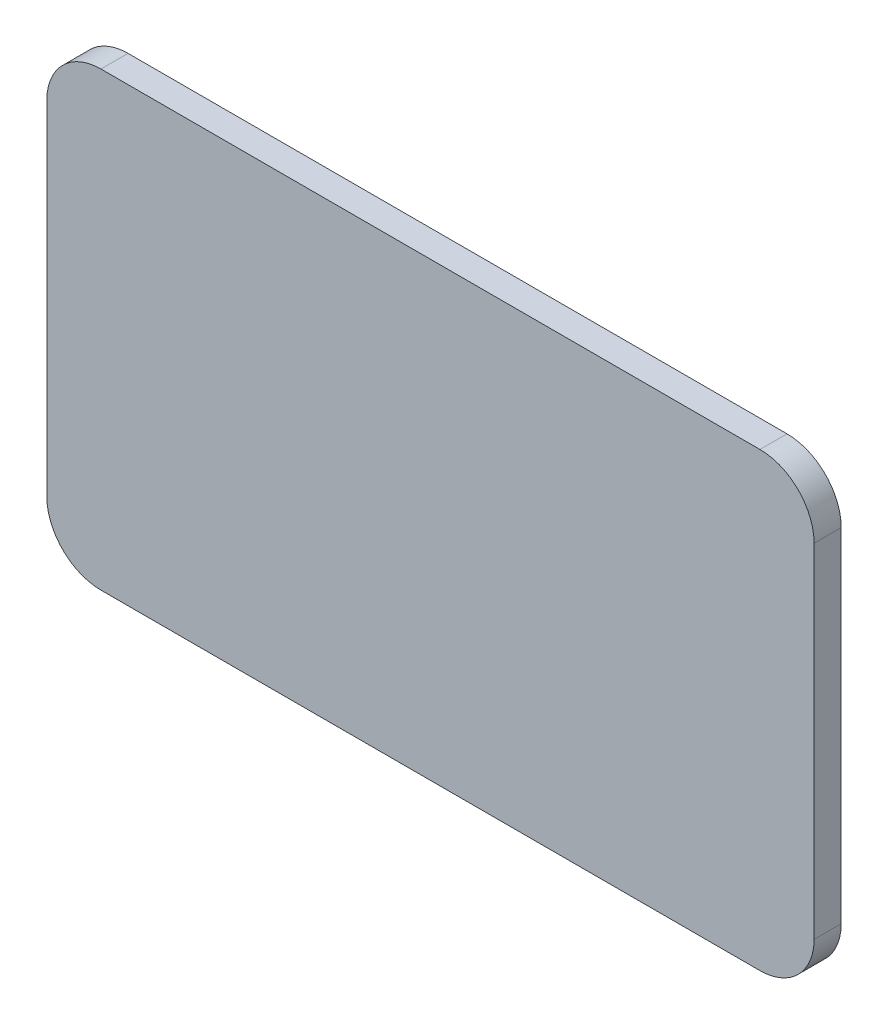
ISO-10303-21;
HEADER;
FILE_DESCRIPTION(('STEP AP214'),'2;1');
FILE_NAME('part.step','',(''),(''),'','','');
FILE_SCHEMA(('AUTOMOTIVE_DESIGN { 1 0 10303 214 1 1 1 1 }'));
ENDSEC;
DATA;
#1=APPLICATION_CONTEXT('core data for automotive mechanical design processes');
#2=APPLICATION_PROTOCOL_DEFINITION('international standard','automotive_design',2000,#1);
#3=PRODUCT_CONTEXT('',#1,'mechanical');
#4=PRODUCT('Part','Part','',(#3));
#5=PRODUCT_RELATED_PRODUCT_CATEGORY('part','',(#4));
#6=PRODUCT_DEFINITION_FORMATION('','',#4);
#7=PRODUCT_DEFINITION_CONTEXT('part definition',#1,'design');
#8=PRODUCT_DEFINITION('design','',#6,#7);
#9=PRODUCT_DEFINITION_SHAPE('','',#8);
#10=(LENGTH_UNIT() NAMED_UNIT(*) SI_UNIT(.MILLI.,.METRE.));
#11=(NAMED_UNIT(*) PLANE_ANGLE_UNIT() SI_UNIT($,.RADIAN.));
#12=(NAMED_UNIT(*) SI_UNIT($,.STERADIAN.) SOLID_ANGLE_UNIT());
#13=UNCERTAINTY_MEASURE_WITH_UNIT(LENGTH_MEASURE(1.E-05),#10,'distance_accuracy_value','');
#14=(GEOMETRIC_REPRESENTATION_CONTEXT(3) GLOBAL_UNCERTAINTY_ASSIGNED_CONTEXT((#13)) GLOBAL_UNIT_ASSIGNED_CONTEXT((#10,
#11,#12)) REPRESENTATION_CONTEXT('',''));
#15=CARTESIAN_POINT('',(0.,0.,0.));
#16=DIRECTION('',(0.,0.,1.));
#17=DIRECTION('',(1.,0.,0.));
#18=AXIS2_PLACEMENT_3D('',#15,#16,#17);
#19=CARTESIAN_POINT('',(0.,-25.,3.));
#20=DIRECTION('',(0.,1.,0.));
#21=DIRECTION('',(0.,0.,1.));
#22=AXIS2_PLACEMENT_3D('',#19,#20,#21);
#23=PLANE('',#22);
#24=DIRECTION('',(1.,0.,0.));
#25=VECTOR('',#24,1.);
#26=CARTESIAN_POINT('',(0.,-25.,0.));
#27=LINE('',#26,#25);
#28=CARTESIAN_POINT('',(-36.5,-25.,0.));
#29=VERTEX_POINT('',#28);
#30=CARTESIAN_POINT('',(36.5,-25.,0.));
#31=VERTEX_POINT('',#30);
#32=EDGE_CURVE('E132',#29,#31,#27,.T.);
#33=ORIENTED_EDGE('',*,*,#32,.T.);
#34=DIRECTION('',(0.,0.,-1.));
#35=VECTOR('',#34,1.);
#36=CARTESIAN_POINT('',(36.5,-25.,3.));
#37=LINE('',#36,#35);
#38=CARTESIAN_POINT('',(36.5,-25.,3.));
#39=VERTEX_POINT('',#38);
#40=EDGE_CURVE('E11',#39,#31,#37,.T.);
#41=ORIENTED_EDGE('',*,*,#40,.F.);
#42=DIRECTION('',(1.,0.,0.));
#43=VECTOR('',#42,1.);
#44=CARTESIAN_POINT('',(0.,-25.,3.));
#45=LINE('',#44,#43);
#46=CARTESIAN_POINT('',(-36.5,-25.,3.));
#47=VERTEX_POINT('',#46);
#48=EDGE_CURVE('E151',#47,#39,#45,.T.);
#49=ORIENTED_EDGE('',*,*,#48,.F.);
#50=DIRECTION('',(0.,0.,-1.));
#51=VECTOR('',#50,1.);
#52=CARTESIAN_POINT('',(-36.5,-25.,3.));
#53=LINE('',#52,#51);
#54=EDGE_CURVE('E51',#47,#29,#53,.T.);
#55=ORIENTED_EDGE('',*,*,#54,.T.);
#56=EDGE_LOOP('',(#33,#41,#49,#55));
#57=FACE_BOUND('',#56,.T.);
#58=ADVANCED_FACE('F35',(#57),#23,.F.);
#59=CARTESIAN_POINT('',(36.5,-19.,3.));
#60=DIRECTION('',(0.,0.,-1.));
#61=DIRECTION('',(-1.,0.,0.));
#62=AXIS2_PLACEMENT_3D('',#59,#60,#61);
#63=CYLINDRICAL_SURFACE('',#62,6.);
#64=CARTESIAN_POINT('',(36.5,-19.,0.));
#65=DIRECTION('',(0.,0.,1.));
#66=DIRECTION('',(1.,0.,0.));
#67=AXIS2_PLACEMENT_3D('',#64,#65,#66);
#68=CIRCLE('',#67,6.);
#69=CARTESIAN_POINT('',(42.5,-19.,0.));
#70=VERTEX_POINT('',#69);
#71=EDGE_CURVE('E134',#31,#70,#68,.T.);
#72=ORIENTED_EDGE('',*,*,#71,.T.);
#73=DIRECTION('',(0.,0.,-1.));
#74=VECTOR('',#73,1.);
#75=CARTESIAN_POINT('',(42.5,-19.,3.));
#76=LINE('',#75,#74);
#77=CARTESIAN_POINT('',(42.5,-19.,3.));
#78=VERTEX_POINT('',#77);
#79=EDGE_CURVE('E43',#78,#70,#76,.T.);
#80=ORIENTED_EDGE('',*,*,#79,.F.);
#81=CARTESIAN_POINT('',(36.5,-19.,3.));
#82=DIRECTION('',(0.,0.,1.));
#83=DIRECTION('',(1.,0.,0.));
#84=AXIS2_PLACEMENT_3D('',#81,#82,#83);
#85=CIRCLE('',#84,6.);
#86=EDGE_CURVE('E89',#39,#78,#85,.T.);
#87=ORIENTED_EDGE('',*,*,#86,.F.);
#88=ORIENTED_EDGE('',*,*,#40,.T.);
#89=EDGE_LOOP('',(#72,#80,#87,#88));
#90=FACE_BOUND('',#89,.T.);
#91=ADVANCED_FACE('F178',(#90),#63,.T.);
#92=CARTESIAN_POINT('',(42.5,0.,3.));
#93=DIRECTION('',(-1.,0.,0.));
#94=DIRECTION('',(0.,0.,1.));
#95=AXIS2_PLACEMENT_3D('',#92,#93,#94);
#96=PLANE('',#95);
#97=DIRECTION('',(0.,1.,0.));
#98=VECTOR('',#97,1.);
#99=CARTESIAN_POINT('',(42.5,0.,0.));
#100=LINE('',#99,#98);
#101=CARTESIAN_POINT('',(42.5,19.,0.));
#102=VERTEX_POINT('',#101);
#103=EDGE_CURVE('E136',#70,#102,#100,.T.);
#104=ORIENTED_EDGE('',*,*,#103,.T.);
#105=DIRECTION('',(0.,0.,-1.));
#106=VECTOR('',#105,1.);
#107=CARTESIAN_POINT('',(42.5,19.,3.));
#108=LINE('',#107,#106);
#109=CARTESIAN_POINT('',(42.5,19.,3.));
#110=VERTEX_POINT('',#109);
#111=EDGE_CURVE('E157',#110,#102,#108,.T.);
#112=ORIENTED_EDGE('',*,*,#111,.F.);
#113=DIRECTION('',(0.,1.,0.));
#114=VECTOR('',#113,1.);
#115=CARTESIAN_POINT('',(42.5,0.,3.));
#116=LINE('',#115,#114);
#117=EDGE_CURVE('E164',#78,#110,#116,.T.);
#118=ORIENTED_EDGE('',*,*,#117,.F.);
#119=ORIENTED_EDGE('',*,*,#79,.T.);
#120=EDGE_LOOP('',(#104,#112,#118,#119));
#121=FACE_BOUND('',#120,.T.);
#122=ADVANCED_FACE('F162',(#121),#96,.F.);
#123=CARTESIAN_POINT('',(36.5,19.,3.));
#124=DIRECTION('',(0.,0.,-1.));
#125=DIRECTION('',(-1.,0.,0.));
#126=AXIS2_PLACEMENT_3D('',#123,#124,#125);
#127=CYLINDRICAL_SURFACE('',#126,6.);
#128=CARTESIAN_POINT('',(36.5,19.,0.));
#129=DIRECTION('',(0.,0.,1.));
#130=DIRECTION('',(1.,0.,0.));
#131=AXIS2_PLACEMENT_3D('',#128,#129,#130);
#132=CIRCLE('',#131,6.);
#133=CARTESIAN_POINT('',(36.5,25.,0.));
#134=VERTEX_POINT('',#133);
#135=EDGE_CURVE('E139',#134,#102,#132,.F.);
#136=ORIENTED_EDGE('',*,*,#135,.F.);
#137=DIRECTION('',(0.,0.,-1.));
#138=VECTOR('',#137,1.);
#139=CARTESIAN_POINT('',(36.5,25.,3.));
#140=LINE('',#139,#138);
#141=CARTESIAN_POINT('',(36.5,25.,3.));
#142=VERTEX_POINT('',#141);
#143=EDGE_CURVE('E155',#142,#134,#140,.T.);
#144=ORIENTED_EDGE('',*,*,#143,.F.);
#145=CARTESIAN_POINT('',(36.5,19.,3.));
#146=DIRECTION('',(0.,0.,1.));
#147=DIRECTION('',(1.,0.,0.));
#148=AXIS2_PLACEMENT_3D('',#145,#146,#147);
#149=CIRCLE('',#148,6.);
#150=EDGE_CURVE('E172',#142,#110,#149,.F.);
#151=ORIENTED_EDGE('',*,*,#150,.T.);
#152=ORIENTED_EDGE('',*,*,#111,.T.);
#153=EDGE_LOOP('',(#136,#144,#151,#152));
#154=FACE_BOUND('',#153,.T.);
#155=ADVANCED_FACE('F170',(#154),#127,.T.);
#156=CARTESIAN_POINT('',(0.,25.,3.));
#157=DIRECTION('',(0.,1.,0.));
#158=DIRECTION('',(0.,0.,1.));
#159=AXIS2_PLACEMENT_3D('',#156,#157,#158);
#160=PLANE('',#159);
#161=DIRECTION('',(1.,0.,0.));
#162=VECTOR('',#161,1.);
#163=CARTESIAN_POINT('',(0.,25.,0.));
#164=LINE('',#163,#162);
#165=CARTESIAN_POINT('',(-36.5,25.,0.));
#166=VERTEX_POINT('',#165);
#167=EDGE_CURVE('E142',#166,#134,#164,.T.);
#168=ORIENTED_EDGE('',*,*,#167,.F.);
#169=DIRECTION('',(0.,0.,-1.));
#170=VECTOR('',#169,1.);
#171=CARTESIAN_POINT('',(-36.5,25.,3.));
#172=LINE('',#171,#170);
#173=CARTESIAN_POINT('',(-36.5,25.,3.));
#174=VERTEX_POINT('',#173);
#175=EDGE_CURVE('E114',#174,#166,#172,.T.);
#176=ORIENTED_EDGE('',*,*,#175,.F.);
#177=DIRECTION('',(1.,0.,0.));
#178=VECTOR('',#177,1.);
#179=CARTESIAN_POINT('',(0.,25.,3.));
#180=LINE('',#179,#178);
#181=EDGE_CURVE('E124',#174,#142,#180,.T.);
#182=ORIENTED_EDGE('',*,*,#181,.T.);
#183=ORIENTED_EDGE('',*,*,#143,.T.);
#184=EDGE_LOOP('',(#168,#176,#182,#183));
#185=FACE_BOUND('',#184,.T.);
#186=ADVANCED_FACE('F188',(#185),#160,.T.);
#187=CARTESIAN_POINT('',(-36.5,19.,3.));
#188=DIRECTION('',(0.,0.,-1.));
#189=DIRECTION('',(-1.,0.,0.));
#190=AXIS2_PLACEMENT_3D('',#187,#188,#189);
#191=CYLINDRICAL_SURFACE('',#190,6.);
#192=CARTESIAN_POINT('',(-36.5,19.,0.));
#193=DIRECTION('',(0.,0.,1.));
#194=DIRECTION('',(1.,0.,0.));
#195=AXIS2_PLACEMENT_3D('',#192,#193,#194);
#196=CIRCLE('',#195,6.);
#197=CARTESIAN_POINT('',(-42.5,19.,0.));
#198=VERTEX_POINT('',#197);
#199=EDGE_CURVE('E110',#198,#166,#196,.F.);
#200=ORIENTED_EDGE('',*,*,#199,.F.);
#201=DIRECTION('',(0.,0.,-1.));
#202=VECTOR('',#201,1.);
#203=CARTESIAN_POINT('',(-42.5,19.,3.));
#204=LINE('',#203,#202);
#205=CARTESIAN_POINT('',(-42.5,19.,3.));
#206=VERTEX_POINT('',#205);
#207=EDGE_CURVE('E105',#206,#198,#204,.T.);
#208=ORIENTED_EDGE('',*,*,#207,.F.);
#209=CARTESIAN_POINT('',(-36.5,19.,3.));
#210=DIRECTION('',(0.,0.,1.));
#211=DIRECTION('',(1.,0.,0.));
#212=AXIS2_PLACEMENT_3D('',#209,#210,#211);
#213=CIRCLE('',#212,6.);
#214=EDGE_CURVE('E108',#206,#174,#213,.F.);
#215=ORIENTED_EDGE('',*,*,#214,.T.);
#216=ORIENTED_EDGE('',*,*,#175,.T.);
#217=EDGE_LOOP('',(#200,#208,#215,#216));
#218=FACE_BOUND('',#217,.T.);
#219=ADVANCED_FACE('F107',(#218),#191,.T.);
#220=CARTESIAN_POINT('',(-42.5,0.,3.));
#221=DIRECTION('',(-1.,0.,0.));
#222=DIRECTION('',(0.,0.,1.));
#223=AXIS2_PLACEMENT_3D('',#220,#221,#222);
#224=PLANE('',#223);
#225=DIRECTION('',(0.,1.,0.));
#226=VECTOR('',#225,1.);
#227=CARTESIAN_POINT('',(-42.5,0.,0.));
#228=LINE('',#227,#226);
#229=CARTESIAN_POINT('',(-42.5,-19.,0.));
#230=VERTEX_POINT('',#229);
#231=EDGE_CURVE('E146',#230,#198,#228,.T.);
#232=ORIENTED_EDGE('',*,*,#231,.F.);
#233=DIRECTION('',(0.,0.,-1.));
#234=VECTOR('',#233,1.);
#235=CARTESIAN_POINT('',(-42.5,-19.,3.));
#236=LINE('',#235,#234);
#237=CARTESIAN_POINT('',(-42.5,-19.,3.));
#238=VERTEX_POINT('',#237);
#239=EDGE_CURVE('E77',#238,#230,#236,.T.);
#240=ORIENTED_EDGE('',*,*,#239,.F.);
#241=DIRECTION('',(0.,1.,0.));
#242=VECTOR('',#241,1.);
#243=CARTESIAN_POINT('',(-42.5,0.,3.));
#244=LINE('',#243,#242);
#245=EDGE_CURVE('E121',#238,#206,#244,.T.);
#246=ORIENTED_EDGE('',*,*,#245,.T.);
#247=ORIENTED_EDGE('',*,*,#207,.T.);
#248=EDGE_LOOP('',(#232,#240,#246,#247));
#249=FACE_BOUND('',#248,.T.);
#250=ADVANCED_FACE('F126',(#249),#224,.T.);
#251=CARTESIAN_POINT('',(-36.5,-19.,3.));
#252=DIRECTION('',(0.,0.,-1.));
#253=DIRECTION('',(-1.,0.,0.));
#254=AXIS2_PLACEMENT_3D('',#251,#252,#253);
#255=CYLINDRICAL_SURFACE('',#254,6.);
#256=CARTESIAN_POINT('',(-36.5,-19.,0.));
#257=DIRECTION('',(0.,0.,1.));
#258=DIRECTION('',(1.,0.,0.));
#259=AXIS2_PLACEMENT_3D('',#256,#257,#258);
#260=CIRCLE('',#259,6.);
#261=EDGE_CURVE('E148',#29,#230,#260,.F.);
#262=ORIENTED_EDGE('',*,*,#261,.F.);
#263=ORIENTED_EDGE('',*,*,#54,.F.);
#264=CARTESIAN_POINT('',(-36.5,-19.,3.));
#265=DIRECTION('',(0.,0.,1.));
#266=DIRECTION('',(1.,0.,0.));
#267=AXIS2_PLACEMENT_3D('',#264,#265,#266);
#268=CIRCLE('',#267,6.);
#269=EDGE_CURVE('E127',#47,#238,#268,.F.);
#270=ORIENTED_EDGE('',*,*,#269,.T.);
#271=ORIENTED_EDGE('',*,*,#239,.T.);
#272=EDGE_LOOP('',(#262,#263,#270,#271));
#273=FACE_BOUND('',#272,.T.);
#274=ADVANCED_FACE('F196',(#273),#255,.T.);
#275=CARTESIAN_POINT('',(0.,0.,3.));
#276=DIRECTION('',(0.,0.,1.));
#277=DIRECTION('',(1.,0.,0.));
#278=AXIS2_PLACEMENT_3D('',#275,#276,#277);
#279=PLANE('',#278);
#280=ORIENTED_EDGE('',*,*,#48,.T.);
#281=ORIENTED_EDGE('',*,*,#86,.T.);
#282=ORIENTED_EDGE('',*,*,#117,.T.);
#283=ORIENTED_EDGE('',*,*,#150,.F.);
#284=ORIENTED_EDGE('',*,*,#181,.F.);
#285=ORIENTED_EDGE('',*,*,#214,.F.);
#286=ORIENTED_EDGE('',*,*,#245,.F.);
#287=ORIENTED_EDGE('',*,*,#269,.F.);
#288=EDGE_LOOP('',(#280,#281,#282,#283,#284,#285,#286,#287));
#289=FACE_BOUND('',#288,.T.);
#290=ADVANCED_FACE('F119',(#289),#279,.T.);
#291=CARTESIAN_POINT('',(0.,0.,0.));
#292=DIRECTION('',(0.,0.,1.));
#293=DIRECTION('',(1.,0.,0.));
#294=AXIS2_PLACEMENT_3D('',#291,#292,#293);
#295=PLANE('',#294);
#296=ORIENTED_EDGE('',*,*,#32,.F.);
#297=ORIENTED_EDGE('',*,*,#261,.T.);
#298=ORIENTED_EDGE('',*,*,#231,.T.);
#299=ORIENTED_EDGE('',*,*,#199,.T.);
#300=ORIENTED_EDGE('',*,*,#167,.T.);
#301=ORIENTED_EDGE('',*,*,#135,.T.);
#302=ORIENTED_EDGE('',*,*,#103,.F.);
#303=ORIENTED_EDGE('',*,*,#71,.F.);
#304=EDGE_LOOP('',(#296,#297,#298,#299,#300,#301,#302,#303));
#305=FACE_BOUND('',#304,.T.);
#306=ADVANCED_FACE('F166',(#305),#295,.F.);
#307=CLOSED_SHELL('',(#58,#91,#122,#155,#186,#219,#250,#274,#290,#306));
#308=MANIFOLD_SOLID_BREP('B2',#307);
#309=ADVANCED_BREP_SHAPE_REPRESENTATION('',(#18,#308),#14);
#310=SHAPE_DEFINITION_REPRESENTATION(#9,#309);
ENDSEC;
END-ISO-10303-21;
